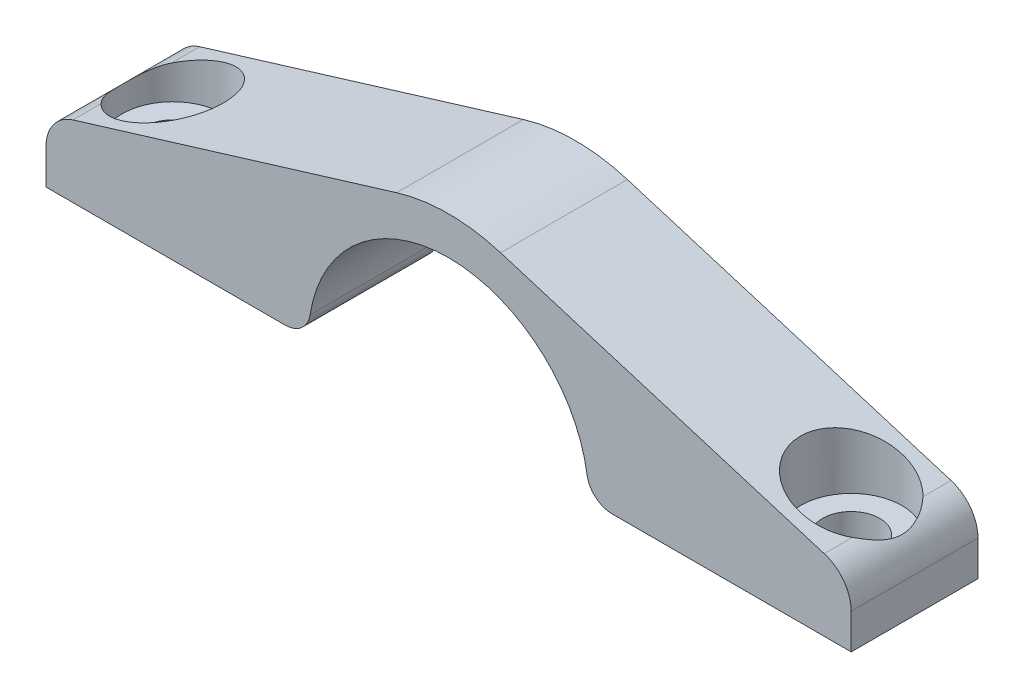
ISO-10303-21;
HEADER;
FILE_DESCRIPTION(('STEP AP214'),'2;1');
FILE_NAME('part.step','',(''),(''),'','','');
FILE_SCHEMA(('AUTOMOTIVE_DESIGN { 1 0 10303 214 1 1 1 1 }'));
ENDSEC;
DATA;
#1=APPLICATION_CONTEXT('core data for automotive mechanical design processes');
#2=APPLICATION_PROTOCOL_DEFINITION('international standard','automotive_design',2000,#1);
#3=PRODUCT_CONTEXT('',#1,'mechanical');
#4=PRODUCT('Part','Part','',(#3));
#5=PRODUCT_RELATED_PRODUCT_CATEGORY('part','',(#4));
#6=PRODUCT_DEFINITION_FORMATION('','',#4);
#7=PRODUCT_DEFINITION_CONTEXT('part definition',#1,'design');
#8=PRODUCT_DEFINITION('design','',#6,#7);
#9=PRODUCT_DEFINITION_SHAPE('','',#8);
#10=(LENGTH_UNIT() NAMED_UNIT(*) SI_UNIT(.MILLI.,.METRE.));
#11=(NAMED_UNIT(*) PLANE_ANGLE_UNIT() SI_UNIT($,.RADIAN.));
#12=(NAMED_UNIT(*) SI_UNIT($,.STERADIAN.) SOLID_ANGLE_UNIT());
#13=UNCERTAINTY_MEASURE_WITH_UNIT(LENGTH_MEASURE(1.E-05),#10,'distance_accuracy_value','');
#14=(GEOMETRIC_REPRESENTATION_CONTEXT(3) GLOBAL_UNCERTAINTY_ASSIGNED_CONTEXT((#13)) GLOBAL_UNIT_ASSIGNED_CONTEXT((#10,
#11,#12)) REPRESENTATION_CONTEXT('',''));
#15=CARTESIAN_POINT('',(0.,0.,0.));
#16=DIRECTION('',(0.,0.,1.));
#17=DIRECTION('',(1.,0.,0.));
#18=AXIS2_PLACEMENT_3D('',#15,#16,#17);
#19=CARTESIAN_POINT('',(0.,0.,10.));
#20=DIRECTION('',(0.,0.,-1.));
#21=DIRECTION('',(-1.,0.,0.));
#22=AXIS2_PLACEMENT_3D('',#19,#20,#21);
#23=CYLINDRICAL_SURFACE('',#22,11.05);
#24=CARTESIAN_POINT('',(0.,0.,0.));
#25=DIRECTION('',(0.,0.,-1.));
#26=DIRECTION('',(-1.,0.,0.));
#27=AXIS2_PLACEMENT_3D('',#24,#25,#26);
#28=CIRCLE('',#27,11.05);
#29=CARTESIAN_POINT('',(-10.9194598387173,1.69348659003831,0.));
#30=VERTEX_POINT('',#29);
#31=CARTESIAN_POINT('',(10.9194598387173,1.69348659003831,0.));
#32=VERTEX_POINT('',#31);
#33=EDGE_CURVE('E181',#30,#32,#28,.T.);
#34=ORIENTED_EDGE('',*,*,#33,.T.);
#35=DIRECTION('',(0.,0.,-1.));
#36=VECTOR('',#35,1.);
#37=CARTESIAN_POINT('',(10.9194598387173,1.69348659003831,10.));
#38=LINE('',#37,#36);
#39=CARTESIAN_POINT('',(10.9194598387173,1.69348659003831,10.));
#40=VERTEX_POINT('',#39);
#41=EDGE_CURVE('E220',#32,#40,#38,.F.);
#42=ORIENTED_EDGE('',*,*,#41,.T.);
#43=CARTESIAN_POINT('',(0.,0.,10.));
#44=DIRECTION('',(0.,0.,-1.));
#45=DIRECTION('',(-1.,0.,0.));
#46=AXIS2_PLACEMENT_3D('',#43,#44,#45);
#47=CIRCLE('',#46,11.05);
#48=CARTESIAN_POINT('',(-10.9194598387173,1.69348659003831,10.));
#49=VERTEX_POINT('',#48);
#50=EDGE_CURVE('E151',#49,#40,#47,.T.);
#51=ORIENTED_EDGE('',*,*,#50,.F.);
#52=DIRECTION('',(0.,0.,-1.));
#53=VECTOR('',#52,1.);
#54=CARTESIAN_POINT('',(-10.9194598387173,1.69348659003831,10.));
#55=LINE('',#54,#53);
#56=EDGE_CURVE('E217',#49,#30,#55,.T.);
#57=ORIENTED_EDGE('',*,*,#56,.T.);
#58=EDGE_LOOP('',(#34,#42,#51,#57));
#59=FACE_BOUND('',#58,.T.);
#60=ADVANCED_FACE('F38',(#59),#23,.F.);
#61=CARTESIAN_POINT('',(31.75,0.,10.));
#62=DIRECTION('',(0.,1.,0.));
#63=DIRECTION('',(0.,0.,1.));
#64=AXIS2_PLACEMENT_3D('',#61,#62,#63);
#65=PLANE('',#64);
#66=CARTESIAN_POINT('',(26.75,0.,5.));
#67=DIRECTION('',(0.,1.,0.));
#68=DIRECTION('',(0.,0.,1.));
#69=AXIS2_PLACEMENT_3D('',#66,#67,#68);
#70=CIRCLE('',#69,2.25);
#71=CARTESIAN_POINT('',(26.75,0.,7.25));
#72=VERTEX_POINT('',#71);
#73=EDGE_CURVE('E318',#72,#72,#70,.T.);
#74=ORIENTED_EDGE('',*,*,#73,.T.);
#75=EDGE_LOOP('',(#74));
#76=FACE_BOUND('',#75,.T.);
#77=DIRECTION('',(1.,0.,0.));
#78=VECTOR('',#77,1.);
#79=CARTESIAN_POINT('',(31.75,0.,10.));
#80=LINE('',#79,#78);
#81=CARTESIAN_POINT('',(12.8958326602046,0.,10.));
#82=VERTEX_POINT('',#81);
#83=CARTESIAN_POINT('',(31.75,0.,10.));
#84=VERTEX_POINT('',#83);
#85=EDGE_CURVE('E138',#82,#84,#80,.T.);
#86=ORIENTED_EDGE('',*,*,#85,.F.);
#87=DIRECTION('',(0.,0.,-1.));
#88=VECTOR('',#87,1.);
#89=CARTESIAN_POINT('',(12.8958326602046,0.,10.));
#90=LINE('',#89,#88);
#91=CARTESIAN_POINT('',(12.8958326602046,0.,0.));
#92=VERTEX_POINT('',#91);
#93=EDGE_CURVE('E211',#82,#92,#90,.T.);
#94=ORIENTED_EDGE('',*,*,#93,.T.);
#95=DIRECTION('',(1.,0.,0.));
#96=VECTOR('',#95,1.);
#97=CARTESIAN_POINT('',(31.75,0.,0.));
#98=LINE('',#97,#96);
#99=CARTESIAN_POINT('',(31.75,0.,0.));
#100=VERTEX_POINT('',#99);
#101=EDGE_CURVE('E157',#92,#100,#98,.T.);
#102=ORIENTED_EDGE('',*,*,#101,.T.);
#103=DIRECTION('',(0.,0.,-1.));
#104=VECTOR('',#103,1.);
#105=CARTESIAN_POINT('',(31.75,0.,10.));
#106=LINE('',#105,#104);
#107=EDGE_CURVE('E154',#84,#100,#106,.T.);
#108=ORIENTED_EDGE('',*,*,#107,.F.);
#109=EDGE_LOOP('',(#86,#94,#102,#108));
#110=FACE_BOUND('',#109,.T.);
#111=ADVANCED_FACE('F155',(#76,#110),#65,.F.);
#112=CARTESIAN_POINT('',(31.75,5.,10.));
#113=DIRECTION('',(-1.,0.,0.));
#114=DIRECTION('',(0.,0.,1.));
#115=AXIS2_PLACEMENT_3D('',#112,#113,#114);
#116=PLANE('',#115);
#117=DIRECTION('',(0.,1.,0.));
#118=VECTOR('',#117,1.);
#119=CARTESIAN_POINT('',(31.75,5.,0.));
#120=LINE('',#119,#118);
#121=CARTESIAN_POINT('',(31.75,2.77896608610913,0.));
#122=VERTEX_POINT('',#121);
#123=EDGE_CURVE('E186',#100,#122,#120,.T.);
#124=ORIENTED_EDGE('',*,*,#123,.T.);
#125=DIRECTION('',(0.,0.,-1.));
#126=VECTOR('',#125,1.);
#127=CARTESIAN_POINT('',(31.75,2.77896608610913,10.));
#128=LINE('',#127,#126);
#129=CARTESIAN_POINT('',(31.75,2.77896608610913,10.));
#130=VERTEX_POINT('',#129);
#131=EDGE_CURVE('E11',#122,#130,#128,.F.);
#132=ORIENTED_EDGE('',*,*,#131,.T.);
#133=DIRECTION('',(0.,1.,0.));
#134=VECTOR('',#133,1.);
#135=CARTESIAN_POINT('',(31.75,5.,10.));
#136=LINE('',#135,#134);
#137=EDGE_CURVE('E143',#84,#130,#136,.T.);
#138=ORIENTED_EDGE('',*,*,#137,.F.);
#139=ORIENTED_EDGE('',*,*,#107,.T.);
#140=EDGE_LOOP('',(#124,#132,#138,#139));
#141=FACE_BOUND('',#140,.T.);
#142=ADVANCED_FACE('F164',(#141),#116,.F.);
#143=CARTESIAN_POINT('',(31.75,5.,10.));
#144=DIRECTION('',(-0.291897709873633,-0.95644954230243,0.));
#145=DIRECTION('',(0.95644954230243,-0.291897709873633,0.));
#146=AXIS2_PLACEMENT_3D('',#143,#144,#145);
#147=PLANE('',#146);
#148=DIRECTION('',(-0.95644954230243,0.291897709873633,0.));
#149=VECTOR('',#148,1.);
#150=CARTESIAN_POINT('',(31.75,5.,10.));
#151=LINE('',#150,#149);
#152=CARTESIAN_POINT('',(29.6256931296209,5.64831471301642,10.));
#153=VERTEX_POINT('',#152);
#154=CARTESIAN_POINT('',(4.10116282372454,13.4381160693491,10.));
#155=VERTEX_POINT('',#154);
#156=EDGE_CURVE('E166',#153,#155,#151,.T.);
#157=ORIENTED_EDGE('',*,*,#156,.F.);
#158=DIRECTION('',(0.,0.,-1.));
#159=VECTOR('',#158,1.);
#160=CARTESIAN_POINT('',(29.6256931296209,5.64831471301642,10.));
#161=LINE('',#160,#159);
#162=CARTESIAN_POINT('',(29.6256931296209,5.64831471301642,7.78035771516025));
#163=VERTEX_POINT('',#162);
#164=EDGE_CURVE('E337',#153,#163,#161,.T.);
#165=ORIENTED_EDGE('',*,*,#164,.T.);
#166=CARTESIAN_POINT('',(26.75,6.52594411395167,5.));
#167=DIRECTION('',(-0.291897709873633,-0.95644954230243,0.));
#168=DIRECTION('',(-0.95644954230243,0.291897709873633,0.));
#169=AXIS2_PLACEMENT_3D('',#166,#167,#168);
#170=ELLIPSE('',#169,4.18213384301583,3.99999999999999);
#171=CARTESIAN_POINT('',(29.6256931296209,5.64831471301642,2.21964228483975));
#172=VERTEX_POINT('',#171);
#173=EDGE_CURVE('E209',#163,#172,#170,.T.);
#174=ORIENTED_EDGE('',*,*,#173,.T.);
#175=DIRECTION('',(0.,0.,-1.));
#176=VECTOR('',#175,1.);
#177=CARTESIAN_POINT('',(29.6256931296209,5.64831471301642,10.));
#178=LINE('',#177,#176);
#179=CARTESIAN_POINT('',(29.6256931296209,5.64831471301642,0.));
#180=VERTEX_POINT('',#179);
#181=EDGE_CURVE('E335',#172,#180,#178,.T.);
#182=ORIENTED_EDGE('',*,*,#181,.T.);
#183=DIRECTION('',(-0.95644954230243,0.291897709873633,0.));
#184=VECTOR('',#183,1.);
#185=CARTESIAN_POINT('',(31.75,5.,0.));
#186=LINE('',#185,#184);
#187=CARTESIAN_POINT('',(4.10116282372454,13.4381160693491,0.));
#188=VERTEX_POINT('',#187);
#189=EDGE_CURVE('E188',#180,#188,#186,.T.);
#190=ORIENTED_EDGE('',*,*,#189,.T.);
#191=DIRECTION('',(0.,0.,-1.));
#192=VECTOR('',#191,1.);
#193=CARTESIAN_POINT('',(4.10116282372454,13.4381160693491,10.));
#194=LINE('',#193,#192);
#195=EDGE_CURVE('E162',#155,#188,#194,.T.);
#196=ORIENTED_EDGE('',*,*,#195,.F.);
#197=EDGE_LOOP('',(#157,#165,#174,#182,#190,#196));
#198=FACE_BOUND('',#197,.T.);
#199=ADVANCED_FACE('F278',(#198),#147,.F.);
#200=CARTESIAN_POINT('',(0.,0.,10.));
#201=DIRECTION('',(0.,0.,-1.));
#202=DIRECTION('',(-1.,0.,0.));
#203=AXIS2_PLACEMENT_3D('',#200,#201,#202);
#204=CYLINDRICAL_SURFACE('',#203,14.05);
#205=CARTESIAN_POINT('',(0.,0.,0.));
#206=DIRECTION('',(0.,0.,1.));
#207=DIRECTION('',(-1.,0.,0.));
#208=AXIS2_PLACEMENT_3D('',#205,#206,#207);
#209=CIRCLE('',#208,14.05);
#210=CARTESIAN_POINT('',(-4.10116282372454,13.4381160693491,0.));
#211=VERTEX_POINT('',#210);
#212=EDGE_CURVE('E190',#188,#211,#209,.T.);
#213=ORIENTED_EDGE('',*,*,#212,.T.);
#214=DIRECTION('',(0.,0.,-1.));
#215=VECTOR('',#214,1.);
#216=CARTESIAN_POINT('',(-4.10116282372454,13.4381160693491,10.));
#217=LINE('',#216,#215);
#218=CARTESIAN_POINT('',(-4.10116282372454,13.4381160693491,10.));
#219=VERTEX_POINT('',#218);
#220=EDGE_CURVE('E202',#219,#211,#217,.T.);
#221=ORIENTED_EDGE('',*,*,#220,.F.);
#222=CARTESIAN_POINT('',(0.,0.,10.));
#223=DIRECTION('',(0.,0.,1.));
#224=DIRECTION('',(-1.,0.,0.));
#225=AXIS2_PLACEMENT_3D('',#222,#223,#224);
#226=CIRCLE('',#225,14.05);
#227=EDGE_CURVE('E168',#155,#219,#226,.T.);
#228=ORIENTED_EDGE('',*,*,#227,.F.);
#229=ORIENTED_EDGE('',*,*,#195,.T.);
#230=EDGE_LOOP('',(#213,#221,#228,#229));
#231=FACE_BOUND('',#230,.T.);
#232=ADVANCED_FACE('F274',(#231),#204,.T.);
#233=CARTESIAN_POINT('',(-31.75,5.,10.));
#234=DIRECTION('',(0.291897709873633,-0.95644954230243,0.));
#235=DIRECTION('',(0.95644954230243,0.291897709873633,0.));
#236=AXIS2_PLACEMENT_3D('',#233,#234,#235);
#237=PLANE('',#236);
#238=DIRECTION('',(-0.95644954230243,-0.291897709873633,0.));
#239=VECTOR('',#238,1.);
#240=CARTESIAN_POINT('',(-31.75,5.,0.));
#241=LINE('',#240,#239);
#242=CARTESIAN_POINT('',(-29.6256931296209,5.64831471301642,0.));
#243=VERTEX_POINT('',#242);
#244=EDGE_CURVE('E192',#211,#243,#241,.T.);
#245=ORIENTED_EDGE('',*,*,#244,.T.);
#246=DIRECTION('',(0.,0.,-1.));
#247=VECTOR('',#246,1.);
#248=CARTESIAN_POINT('',(-29.6256931296209,5.64831471301642,10.));
#249=LINE('',#248,#247);
#250=CARTESIAN_POINT('',(-29.6256931296209,5.64831471301642,2.21964228483975));
#251=VERTEX_POINT('',#250);
#252=EDGE_CURVE('E236',#243,#251,#249,.F.);
#253=ORIENTED_EDGE('',*,*,#252,.T.);
#254=CARTESIAN_POINT('',(-26.75,6.52594411395167,5.));
#255=DIRECTION('',(0.291897709873633,-0.95644954230243,0.));
#256=DIRECTION('',(-0.95644954230243,-0.291897709873633,0.));
#257=AXIS2_PLACEMENT_3D('',#254,#255,#256);
#258=ELLIPSE('',#257,4.18213384301583,4.);
#259=CARTESIAN_POINT('',(-29.6256931296209,5.64831471301642,7.78035771516025));
#260=VERTEX_POINT('',#259);
#261=EDGE_CURVE('E161',#251,#260,#258,.T.);
#262=ORIENTED_EDGE('',*,*,#261,.T.);
#263=DIRECTION('',(0.,0.,-1.));
#264=VECTOR('',#263,1.);
#265=CARTESIAN_POINT('',(-29.6256931296209,5.64831471301642,10.));
#266=LINE('',#265,#264);
#267=CARTESIAN_POINT('',(-29.6256931296209,5.64831471301642,10.));
#268=VERTEX_POINT('',#267);
#269=EDGE_CURVE('E234',#260,#268,#266,.F.);
#270=ORIENTED_EDGE('',*,*,#269,.T.);
#271=DIRECTION('',(-0.95644954230243,-0.291897709873633,0.));
#272=VECTOR('',#271,1.);
#273=CARTESIAN_POINT('',(-31.75,5.,10.));
#274=LINE('',#273,#272);
#275=EDGE_CURVE('E173',#219,#268,#274,.T.);
#276=ORIENTED_EDGE('',*,*,#275,.F.);
#277=ORIENTED_EDGE('',*,*,#220,.T.);
#278=EDGE_LOOP('',(#245,#253,#262,#270,#276,#277));
#279=FACE_BOUND('',#278,.T.);
#280=ADVANCED_FACE('F270',(#279),#237,.F.);
#281=CARTESIAN_POINT('',(-31.75,5.,10.));
#282=DIRECTION('',(1.,0.,0.));
#283=DIRECTION('',(0.,0.,-1.));
#284=AXIS2_PLACEMENT_3D('',#281,#282,#283);
#285=PLANE('',#284);
#286=DIRECTION('',(0.,-1.,0.));
#287=VECTOR('',#286,1.);
#288=CARTESIAN_POINT('',(-31.75,5.,10.));
#289=LINE('',#288,#287);
#290=CARTESIAN_POINT('',(-31.75,2.77896608610913,10.));
#291=VERTEX_POINT('',#290);
#292=CARTESIAN_POINT('',(-31.75,0.,10.));
#293=VERTEX_POINT('',#292);
#294=EDGE_CURVE('E175',#291,#293,#289,.T.);
#295=ORIENTED_EDGE('',*,*,#294,.F.);
#296=DIRECTION('',(0.,0.,-1.));
#297=VECTOR('',#296,1.);
#298=CARTESIAN_POINT('',(-31.75,2.77896608610913,10.));
#299=LINE('',#298,#297);
#300=CARTESIAN_POINT('',(-31.75,2.77896608610913,0.));
#301=VERTEX_POINT('',#300);
#302=EDGE_CURVE('E227',#291,#301,#299,.T.);
#303=ORIENTED_EDGE('',*,*,#302,.T.);
#304=DIRECTION('',(0.,-1.,0.));
#305=VECTOR('',#304,1.);
#306=CARTESIAN_POINT('',(-31.75,5.,0.));
#307=LINE('',#306,#305);
#308=CARTESIAN_POINT('',(-31.75,0.,0.));
#309=VERTEX_POINT('',#308);
#310=EDGE_CURVE('E195',#301,#309,#307,.T.);
#311=ORIENTED_EDGE('',*,*,#310,.T.);
#312=DIRECTION('',(0.,0.,-1.));
#313=VECTOR('',#312,1.);
#314=CARTESIAN_POINT('',(-31.75,0.,10.));
#315=LINE('',#314,#313);
#316=EDGE_CURVE('E180',#293,#309,#315,.T.);
#317=ORIENTED_EDGE('',*,*,#316,.F.);
#318=EDGE_LOOP('',(#295,#303,#311,#317));
#319=FACE_BOUND('',#318,.T.);
#320=ADVANCED_FACE('F266',(#319),#285,.F.);
#321=CARTESIAN_POINT('',(-31.75,0.,10.));
#322=DIRECTION('',(0.,1.,0.));
#323=DIRECTION('',(0.,0.,1.));
#324=AXIS2_PLACEMENT_3D('',#321,#322,#323);
#325=PLANE('',#324);
#326=CARTESIAN_POINT('',(-26.75,0.,5.));
#327=DIRECTION('',(0.,1.,0.));
#328=DIRECTION('',(0.,0.,1.));
#329=AXIS2_PLACEMENT_3D('',#326,#327,#328);
#330=CIRCLE('',#329,2.25);
#331=CARTESIAN_POINT('',(-26.75,0.,7.25));
#332=VERTEX_POINT('',#331);
#333=EDGE_CURVE('E184',#332,#332,#330,.T.);
#334=ORIENTED_EDGE('',*,*,#333,.T.);
#335=EDGE_LOOP('',(#334));
#336=FACE_BOUND('',#335,.T.);
#337=DIRECTION('',(1.,0.,0.));
#338=VECTOR('',#337,1.);
#339=CARTESIAN_POINT('',(-31.75,0.,0.));
#340=LINE('',#339,#338);
#341=CARTESIAN_POINT('',(-12.8958326602046,0.,0.));
#342=VERTEX_POINT('',#341);
#343=EDGE_CURVE('E197',#309,#342,#340,.T.);
#344=ORIENTED_EDGE('',*,*,#343,.T.);
#345=DIRECTION('',(0.,0.,-1.));
#346=VECTOR('',#345,1.);
#347=CARTESIAN_POINT('',(-12.8958326602046,0.,10.));
#348=LINE('',#347,#346);
#349=CARTESIAN_POINT('',(-12.8958326602046,0.,10.));
#350=VERTEX_POINT('',#349);
#351=EDGE_CURVE('E225',#342,#350,#348,.F.);
#352=ORIENTED_EDGE('',*,*,#351,.T.);
#353=DIRECTION('',(1.,0.,0.));
#354=VECTOR('',#353,1.);
#355=CARTESIAN_POINT('',(-31.75,0.,10.));
#356=LINE('',#355,#354);
#357=EDGE_CURVE('E177',#293,#350,#356,.T.);
#358=ORIENTED_EDGE('',*,*,#357,.F.);
#359=ORIENTED_EDGE('',*,*,#316,.T.);
#360=EDGE_LOOP('',(#344,#352,#358,#359));
#361=FACE_BOUND('',#360,.T.);
#362=ADVANCED_FACE('F260',(#336,#361),#325,.F.);
#363=CARTESIAN_POINT('',(0.,0.,10.));
#364=DIRECTION('',(0.,0.,-1.));
#365=DIRECTION('',(-1.,0.,0.));
#366=AXIS2_PLACEMENT_3D('',#363,#364,#365);
#367=PLANE('',#366);
#368=ORIENTED_EDGE('',*,*,#275,.T.);
#369=CARTESIAN_POINT('',(-28.75,2.77896608610913,10.));
#370=DIRECTION('',(0.,0.,-1.));
#371=DIRECTION('',(-1.,0.,0.));
#372=AXIS2_PLACEMENT_3D('',#369,#370,#371);
#373=CIRCLE('',#372,3.);
#374=EDGE_CURVE('E339',#268,#291,#373,.F.);
#375=ORIENTED_EDGE('',*,*,#374,.T.);
#376=ORIENTED_EDGE('',*,*,#294,.T.);
#377=ORIENTED_EDGE('',*,*,#357,.T.);
#378=CARTESIAN_POINT('',(-12.8958326602046,2.,10.));
#379=DIRECTION('',(0.,0.,-1.));
#380=DIRECTION('',(-1.,0.,0.));
#381=AXIS2_PLACEMENT_3D('',#378,#379,#380);
#382=CIRCLE('',#381,2.);
#383=EDGE_CURVE('E222',#350,#49,#382,.F.);
#384=ORIENTED_EDGE('',*,*,#383,.T.);
#385=ORIENTED_EDGE('',*,*,#50,.T.);
#386=CARTESIAN_POINT('',(12.8958326602046,2.,10.));
#387=DIRECTION('',(0.,0.,-1.));
#388=DIRECTION('',(-1.,0.,0.));
#389=AXIS2_PLACEMENT_3D('',#386,#387,#388);
#390=CIRCLE('',#389,2.);
#391=EDGE_CURVE('E147',#40,#82,#390,.F.);
#392=ORIENTED_EDGE('',*,*,#391,.T.);
#393=ORIENTED_EDGE('',*,*,#85,.T.);
#394=ORIENTED_EDGE('',*,*,#137,.T.);
#395=CARTESIAN_POINT('',(28.75,2.77896608610913,10.));
#396=DIRECTION('',(0.,0.,-1.));
#397=DIRECTION('',(-1.,0.,0.));
#398=AXIS2_PLACEMENT_3D('',#395,#396,#397);
#399=CIRCLE('',#398,3.);
#400=EDGE_CURVE('E244',#130,#153,#399,.F.);
#401=ORIENTED_EDGE('',*,*,#400,.T.);
#402=ORIENTED_EDGE('',*,*,#156,.T.);
#403=ORIENTED_EDGE('',*,*,#227,.T.);
#404=EDGE_LOOP('',(#368,#375,#376,#377,#384,#385,#392,#393,#394,#401,#402,#403));
#405=FACE_BOUND('',#404,.T.);
#406=ADVANCED_FACE('F141',(#405),#367,.F.);
#407=CARTESIAN_POINT('',(0.,0.,0.));
#408=DIRECTION('',(0.,0.,-1.));
#409=DIRECTION('',(-1.,0.,0.));
#410=AXIS2_PLACEMENT_3D('',#407,#408,#409);
#411=PLANE('',#410);
#412=ORIENTED_EDGE('',*,*,#310,.F.);
#413=CARTESIAN_POINT('',(-28.75,2.77896608610913,0.));
#414=DIRECTION('',(0.,0.,-1.));
#415=DIRECTION('',(-1.,0.,0.));
#416=AXIS2_PLACEMENT_3D('',#413,#414,#415);
#417=CIRCLE('',#416,3.);
#418=EDGE_CURVE('E232',#301,#243,#417,.T.);
#419=ORIENTED_EDGE('',*,*,#418,.T.);
#420=ORIENTED_EDGE('',*,*,#244,.F.);
#421=ORIENTED_EDGE('',*,*,#212,.F.);
#422=ORIENTED_EDGE('',*,*,#189,.F.);
#423=CARTESIAN_POINT('',(28.75,2.77896608610913,0.));
#424=DIRECTION('',(0.,0.,-1.));
#425=DIRECTION('',(-1.,0.,0.));
#426=AXIS2_PLACEMENT_3D('',#423,#424,#425);
#427=CIRCLE('',#426,3.);
#428=EDGE_CURVE('E230',#180,#122,#427,.T.);
#429=ORIENTED_EDGE('',*,*,#428,.T.);
#430=ORIENTED_EDGE('',*,*,#123,.F.);
#431=ORIENTED_EDGE('',*,*,#101,.F.);
#432=CARTESIAN_POINT('',(12.8958326602046,2.,0.));
#433=DIRECTION('',(0.,0.,-1.));
#434=DIRECTION('',(-1.,0.,0.));
#435=AXIS2_PLACEMENT_3D('',#432,#433,#434);
#436=CIRCLE('',#435,2.);
#437=EDGE_CURVE('E215',#92,#32,#436,.T.);
#438=ORIENTED_EDGE('',*,*,#437,.T.);
#439=ORIENTED_EDGE('',*,*,#33,.F.);
#440=CARTESIAN_POINT('',(-12.8958326602046,2.,0.));
#441=DIRECTION('',(0.,0.,-1.));
#442=DIRECTION('',(-1.,0.,0.));
#443=AXIS2_PLACEMENT_3D('',#440,#441,#442);
#444=CIRCLE('',#443,2.);
#445=EDGE_CURVE('E213',#30,#342,#444,.T.);
#446=ORIENTED_EDGE('',*,*,#445,.T.);
#447=ORIENTED_EDGE('',*,*,#343,.F.);
#448=EDGE_LOOP('',(#412,#419,#420,#421,#422,#429,#430,#431,#438,#439,#446,#447));
#449=FACE_BOUND('',#448,.T.);
#450=ADVANCED_FACE('F255',(#449),#411,.T.);
#451=CARTESIAN_POINT('',(-26.75,7.,5.));
#452=DIRECTION('',(0.,-1.,0.));
#453=DIRECTION('',(0.,0.,-1.));
#454=AXIS2_PLACEMENT_3D('',#451,#452,#453);
#455=CYLINDRICAL_SURFACE('',#454,4.);
#456=ORIENTED_EDGE('',*,*,#261,.F.);
#457=CARTESIAN_POINT('',(-29.6256931296209,5.64831471301642,2.21964228483975));
#458=CARTESIAN_POINT('',(-29.7123088577774,5.62188068460178,2.30924989376314));
#459=CARTESIAN_POINT('',(-29.7942676823549,5.59258261836363,2.40237657012953));
#460=CARTESIAN_POINT('',(-29.9486676753114,5.53035098994619,2.59504828280792));
#461=CARTESIAN_POINT('',(-30.0211117332531,5.49741853711981,2.69459135675412));
#462=CARTESIAN_POINT('',(-30.1569829481515,5.42966714253461,2.90051901495854));
#463=CARTESIAN_POINT('',(-30.2203164660069,5.39483307734777,3.00696029330476));
#464=CARTESIAN_POINT('',(-30.3369144333084,5.32578630658522,3.22534916340262));
#465=CARTESIAN_POINT('',(-30.3901801287414,5.29157352459427,3.33729607161743));
#466=CARTESIAN_POINT('',(-30.5118772029086,5.20872207157995,3.62727325382415));
#467=CARTESIAN_POINT('',(-30.5734067004213,5.16203607807235,3.80891063901975));
#468=CARTESIAN_POINT('',(-30.6459229315352,5.10413902079427,4.08840266473516));
#469=CARTESIAN_POINT('',(-30.6667765835465,5.08688446706856,4.18254404007751));
#470=CARTESIAN_POINT('',(-30.7017089786908,5.05742094161233,4.37283318135702));
#471=CARTESIAN_POINT('',(-30.7157917585726,5.04520896414608,4.46897971606404));
#472=CARTESIAN_POINT('',(-30.7370520922472,5.02659356404207,4.66368193833046));
#473=CARTESIAN_POINT('',(-30.7441519909324,5.0202555077696,4.76225249257991));
#474=CARTESIAN_POINT('',(-30.7510198914604,5.01412633243836,4.95985081605335));
#475=CARTESIAN_POINT('',(-30.7507883441801,5.014334810774,5.0588785567863));
#476=CARTESIAN_POINT('',(-30.7429899076511,5.02129043656964,5.25657234831845));
#477=CARTESIAN_POINT('',(-30.7354113628385,5.02804797370719,5.35523757432836));
#478=CARTESIAN_POINT('',(-30.7130799681644,5.04756238728618,5.55112083530859));
#479=CARTESIAN_POINT('',(-30.6983260601139,5.06032014860342,5.64833865464205));
#480=CARTESIAN_POINT('',(-30.6407108051431,5.10875046092686,5.95239044108339));
#481=CARTESIAN_POINT('',(-30.5851020948398,5.15383251474597,6.15547947719238));
#482=CARTESIAN_POINT('',(-30.4796237132595,5.23055275400057,6.44943010883753));
#483=CARTESIAN_POINT('',(-30.440712076559,5.25768968058505,6.54576889956834));
#484=CARTESIAN_POINT('',(-30.3557350512444,5.31356836717176,6.73475839326742));
#485=CARTESIAN_POINT('',(-30.3096709334774,5.34230984149933,6.82740974774944));
#486=CARTESIAN_POINT('',(-30.1745294949134,5.42102949837721,7.07471586318187));
#487=CARTESIAN_POINT('',(-30.0784951908023,5.47128405127432,7.22557719620428));
#488=CARTESIAN_POINT('',(-29.9195867794605,5.54219288202463,7.44165164114943));
#489=CARTESIAN_POINT('',(-29.8642844053494,5.56503650298415,7.51182468128541));
#490=CARTESIAN_POINT('',(-29.7487048403234,5.60852354539333,7.64873366780542));
#491=CARTESIAN_POINT('',(-29.6884248928639,5.62916573300832,7.71546767600438));
#492=CARTESIAN_POINT('',(-29.6256931296209,5.64831471301642,7.78035771516025));
#493=B_SPLINE_CURVE_WITH_KNOTS('',3,(#457,#458,#459,#460,#461,#462,#463,#464,#465,#466,#467,
#468,#469,#470,#471,#472,#473,#474,#475,#476,#477,#478,#479,#480,#481,#482,#483,#484,#485,#486,
#487,#488,#489,#490,#491,#492),.UNSPECIFIED.,.F.,.F.,(4,2,2,2,2,2,2,2,2,2,2,2,2,2,2,2,2,4),(0.,
0.381893462427263,0.763670677194117,1.14912763693706,1.53453686151102,2.12400152515476,
2.41756177199783,2.71094678247852,3.0075587680046,3.30415251221351,3.60121755561794,
3.89832642207372,4.54029509602105,4.86224166398023,5.18413109405119,5.73959500720649,
6.01606574086998,6.29269062231022),.UNSPECIFIED.);
#494=EDGE_CURVE('E238',#251,#260,#493,.T.);
#495=ORIENTED_EDGE('',*,*,#494,.T.);
#496=EDGE_LOOP('',(#456,#495));
#497=FACE_BOUND('',#496,.T.);
#498=CARTESIAN_POINT('',(-26.75,3.,5.));
#499=DIRECTION('',(0.,1.,0.));
#500=DIRECTION('',(0.,0.,1.));
#501=AXIS2_PLACEMENT_3D('',#498,#499,#500);
#502=CIRCLE('',#501,3.99999999999999);
#503=CARTESIAN_POINT('',(-26.75,3.,8.99999999999999));
#504=VERTEX_POINT('',#503);
#505=EDGE_CURVE('E315',#504,#504,#502,.T.);
#506=ORIENTED_EDGE('',*,*,#505,.F.);
#507=EDGE_LOOP('',(#506));
#508=FACE_BOUND('',#507,.T.);
#509=ADVANCED_FACE('F249',(#497,#508),#455,.F.);
#510=CARTESIAN_POINT('',(-26.75,7.,5.));
#511=DIRECTION('',(0.,1.,0.));
#512=DIRECTION('',(0.,0.,1.));
#513=AXIS2_PLACEMENT_3D('',#510,#511,#512);
#514=CYLINDRICAL_SURFACE('',#513,2.25000000000001);
#515=ORIENTED_EDGE('',*,*,#333,.F.);
#516=EDGE_LOOP('',(#515));
#517=FACE_BOUND('',#516,.T.);
#518=CARTESIAN_POINT('',(-26.75,3.,5.));
#519=DIRECTION('',(0.,1.,0.));
#520=DIRECTION('',(0.,0.,1.));
#521=AXIS2_PLACEMENT_3D('',#518,#519,#520);
#522=CIRCLE('',#521,2.25000000000001);
#523=CARTESIAN_POINT('',(-26.75,3.,7.25000000000001));
#524=VERTEX_POINT('',#523);
#525=EDGE_CURVE('E312',#524,#524,#522,.T.);
#526=ORIENTED_EDGE('',*,*,#525,.T.);
#527=EDGE_LOOP('',(#526));
#528=FACE_BOUND('',#527,.T.);
#529=ADVANCED_FACE('F254',(#517,#528),#514,.F.);
#530=CARTESIAN_POINT('',(-24.5,3.,5.));
#531=DIRECTION('',(0.,-1.,0.));
#532=DIRECTION('',(0.,0.,-1.));
#533=AXIS2_PLACEMENT_3D('',#530,#531,#532);
#534=PLANE('',#533);
#535=ORIENTED_EDGE('',*,*,#525,.F.);
#536=EDGE_LOOP('',(#535));
#537=FACE_BOUND('',#536,.T.);
#538=ORIENTED_EDGE('',*,*,#505,.T.);
#539=EDGE_LOOP('',(#538));
#540=FACE_BOUND('',#539,.T.);
#541=ADVANCED_FACE('F332',(#537,#540),#534,.F.);
#542=CARTESIAN_POINT('',(26.75,7.00000000000001,5.));
#543=DIRECTION('',(0.,1.,0.));
#544=DIRECTION('',(0.,0.,1.));
#545=AXIS2_PLACEMENT_3D('',#542,#543,#544);
#546=CYLINDRICAL_SURFACE('',#545,3.99999999999999);
#547=CARTESIAN_POINT('',(26.75,3.00000000000001,5.));
#548=DIRECTION('',(0.,1.,0.));
#549=DIRECTION('',(0.,0.,1.));
#550=AXIS2_PLACEMENT_3D('',#547,#548,#549);
#551=CIRCLE('',#550,3.99999999999999);
#552=CARTESIAN_POINT('',(26.75,3.00000000000001,8.99999999999999));
#553=VERTEX_POINT('',#552);
#554=EDGE_CURVE('E324',#553,#553,#551,.T.);
#555=ORIENTED_EDGE('',*,*,#554,.F.);
#556=EDGE_LOOP('',(#555));
#557=FACE_BOUND('',#556,.T.);
#558=ORIENTED_EDGE('',*,*,#173,.F.);
#559=CARTESIAN_POINT('',(29.6256931296209,5.64831471301642,7.78035771516025));
#560=CARTESIAN_POINT('',(29.7123088577774,5.62188068460178,7.69075010623686));
#561=CARTESIAN_POINT('',(29.7942676823549,5.59258261836363,7.59762342987047));
#562=CARTESIAN_POINT('',(29.9486676753115,5.53035098994619,7.40495171719208));
#563=CARTESIAN_POINT('',(30.0211117332531,5.49741853711981,7.30540864324588));
#564=CARTESIAN_POINT('',(30.1569829481515,5.42966714253461,7.09948098504147));
#565=CARTESIAN_POINT('',(30.2203164660069,5.39483307734777,6.99303970669525));
#566=CARTESIAN_POINT('',(30.3369144333084,5.32578630658522,6.77465083659738));
#567=CARTESIAN_POINT('',(30.3901801287414,5.29157352459427,6.66270392838258));
#568=CARTESIAN_POINT('',(30.5118772029086,5.20872207157995,6.37272674617585));
#569=CARTESIAN_POINT('',(30.5734067004213,5.16203607807236,6.19108936098026));
#570=CARTESIAN_POINT('',(30.6459229315352,5.10413902079427,5.91159733526485));
#571=CARTESIAN_POINT('',(30.6667765835465,5.08688446706856,5.8174559599225));
#572=CARTESIAN_POINT('',(30.7017089786908,5.05742094161233,5.62716681864299));
#573=CARTESIAN_POINT('',(30.7157917585726,5.04520896414608,5.53102028393597));
#574=CARTESIAN_POINT('',(30.7370520922472,5.02659356404208,5.33631806166954));
#575=CARTESIAN_POINT('',(30.7441519909325,5.0202555077696,5.2377475074201));
#576=CARTESIAN_POINT('',(30.7510198914604,5.01412633243836,5.04014918394666));
#577=CARTESIAN_POINT('',(30.7507883441801,5.014334810774,4.9411214432137));
#578=CARTESIAN_POINT('',(30.7429899076511,5.02129043656964,4.74342765168155));
#579=CARTESIAN_POINT('',(30.7354113628385,5.02804797370719,4.64476242567165));
#580=CARTESIAN_POINT('',(30.7130799681644,5.04756238728618,4.44887916469142));
#581=CARTESIAN_POINT('',(30.6983260601139,5.06032014860342,4.35166134535796));
#582=CARTESIAN_POINT('',(30.6407108051432,5.10875046092686,4.04760955891662));
#583=CARTESIAN_POINT('',(30.5851020948399,5.15383251474597,3.84452052280763));
#584=CARTESIAN_POINT('',(30.4796237132595,5.23055275400057,3.55056989116247));
#585=CARTESIAN_POINT('',(30.440712076559,5.25768968058504,3.45423110043167));
#586=CARTESIAN_POINT('',(30.3557350512444,5.31356836717176,3.26524160673259));
#587=CARTESIAN_POINT('',(30.3096709334774,5.34230984149933,3.17259025225057));
#588=CARTESIAN_POINT('',(30.1745294949134,5.42102949837721,2.92528413681813));
#589=CARTESIAN_POINT('',(30.0784951908024,5.47128405127432,2.77442280379573));
#590=CARTESIAN_POINT('',(29.9195867794605,5.54219288202463,2.55834835885058));
#591=CARTESIAN_POINT('',(29.8642844053494,5.56503650298415,2.48817531871459));
#592=CARTESIAN_POINT('',(29.7487048403234,5.60852354539334,2.35126633219458));
#593=CARTESIAN_POINT('',(29.6884248928639,5.62916573300832,2.28453232399562));
#594=CARTESIAN_POINT('',(29.6256931296209,5.64831471301642,2.21964228483975));
#595=B_SPLINE_CURVE_WITH_KNOTS('',3,(#559,#560,#561,#562,#563,#564,#565,#566,#567,#568,#569,
#570,#571,#572,#573,#574,#575,#576,#577,#578,#579,#580,#581,#582,#583,#584,#585,#586,#587,#588,
#589,#590,#591,#592,#593,#594),.UNSPECIFIED.,.F.,.F.,(4,2,2,2,2,2,2,2,2,2,2,2,2,2,2,2,2,4),(0.,
0.381893462427263,0.763670677194117,1.14912763693706,1.53453686151102,2.12400152515476,
2.41756177199782,2.71094678247851,3.0075587680046,3.30415251221351,3.60121755561793,
3.89832642207372,4.54029509602104,4.86224166398022,5.18413109405119,5.73959500720649,
6.01606574086999,6.29269062231023),.UNSPECIFIED.);
#596=EDGE_CURVE('E47',#163,#172,#595,.T.);
#597=ORIENTED_EDGE('',*,*,#596,.T.);
#598=EDGE_LOOP('',(#558,#597));
#599=FACE_BOUND('',#598,.T.);
#600=ADVANCED_FACE('F329',(#557,#599),#546,.F.);
#601=CARTESIAN_POINT('',(26.75,7.00000000000001,5.));
#602=DIRECTION('',(0.,1.,0.));
#603=DIRECTION('',(0.,0.,1.));
#604=AXIS2_PLACEMENT_3D('',#601,#602,#603);
#605=CYLINDRICAL_SURFACE('',#604,2.25000000000001);
#606=ORIENTED_EDGE('',*,*,#73,.F.);
#607=EDGE_LOOP('',(#606));
#608=FACE_BOUND('',#607,.T.);
#609=CARTESIAN_POINT('',(26.75,3.00000000000001,5.));
#610=DIRECTION('',(0.,1.,0.));
#611=DIRECTION('',(0.,0.,1.));
#612=AXIS2_PLACEMENT_3D('',#609,#610,#611);
#613=CIRCLE('',#612,2.25000000000001);
#614=CARTESIAN_POINT('',(26.75,3.00000000000001,7.25000000000001));
#615=VERTEX_POINT('',#614);
#616=EDGE_CURVE('E321',#615,#615,#613,.T.);
#617=ORIENTED_EDGE('',*,*,#616,.T.);
#618=EDGE_LOOP('',(#617));
#619=FACE_BOUND('',#618,.T.);
#620=ADVANCED_FACE('F331',(#608,#619),#605,.F.);
#621=CARTESIAN_POINT('',(29.,3.00000000000001,5.));
#622=DIRECTION('',(0.,-1.,0.));
#623=DIRECTION('',(0.,0.,-1.));
#624=AXIS2_PLACEMENT_3D('',#621,#622,#623);
#625=PLANE('',#624);
#626=ORIENTED_EDGE('',*,*,#616,.F.);
#627=EDGE_LOOP('',(#626));
#628=FACE_BOUND('',#627,.T.);
#629=ORIENTED_EDGE('',*,*,#554,.T.);
#630=EDGE_LOOP('',(#629));
#631=FACE_BOUND('',#630,.T.);
#632=ADVANCED_FACE('F294',(#628,#631),#625,.F.);
#633=CARTESIAN_POINT('',(12.8958326602046,2.,10.));
#634=DIRECTION('',(0.,0.,-1.));
#635=DIRECTION('',(-1.,0.,0.));
#636=AXIS2_PLACEMENT_3D('',#633,#634,#635);
#637=CYLINDRICAL_SURFACE('',#636,2.);
#638=ORIENTED_EDGE('',*,*,#391,.F.);
#639=ORIENTED_EDGE('',*,*,#41,.F.);
#640=ORIENTED_EDGE('',*,*,#437,.F.);
#641=ORIENTED_EDGE('',*,*,#93,.F.);
#642=EDGE_LOOP('',(#638,#639,#640,#641));
#643=FACE_BOUND('',#642,.T.);
#644=ADVANCED_FACE('F291',(#643),#637,.T.);
#645=CARTESIAN_POINT('',(-12.8958326602046,2.,10.));
#646=DIRECTION('',(0.,0.,-1.));
#647=DIRECTION('',(-1.,0.,0.));
#648=AXIS2_PLACEMENT_3D('',#645,#646,#647);
#649=CYLINDRICAL_SURFACE('',#648,2.);
#650=ORIENTED_EDGE('',*,*,#383,.F.);
#651=ORIENTED_EDGE('',*,*,#351,.F.);
#652=ORIENTED_EDGE('',*,*,#445,.F.);
#653=ORIENTED_EDGE('',*,*,#56,.F.);
#654=EDGE_LOOP('',(#650,#651,#652,#653));
#655=FACE_BOUND('',#654,.T.);
#656=ADVANCED_FACE('F293',(#655),#649,.T.);
#657=CARTESIAN_POINT('',(-28.75,2.77896608610913,10.));
#658=DIRECTION('',(0.,0.,-1.));
#659=DIRECTION('',(-1.,0.,0.));
#660=AXIS2_PLACEMENT_3D('',#657,#658,#659);
#661=CYLINDRICAL_SURFACE('',#660,3.);
#662=ORIENTED_EDGE('',*,*,#494,.F.);
#663=ORIENTED_EDGE('',*,*,#252,.F.);
#664=ORIENTED_EDGE('',*,*,#418,.F.);
#665=ORIENTED_EDGE('',*,*,#302,.F.);
#666=ORIENTED_EDGE('',*,*,#374,.F.);
#667=ORIENTED_EDGE('',*,*,#269,.F.);
#668=EDGE_LOOP('',(#662,#663,#664,#665,#666,#667));
#669=FACE_BOUND('',#668,.T.);
#670=ADVANCED_FACE('F246',(#669),#661,.T.);
#671=CARTESIAN_POINT('',(28.75,2.77896608610913,10.));
#672=DIRECTION('',(0.,0.,-1.));
#673=DIRECTION('',(-1.,0.,0.));
#674=AXIS2_PLACEMENT_3D('',#671,#672,#673);
#675=CYLINDRICAL_SURFACE('',#674,3.);
#676=ORIENTED_EDGE('',*,*,#400,.F.);
#677=ORIENTED_EDGE('',*,*,#131,.F.);
#678=ORIENTED_EDGE('',*,*,#428,.F.);
#679=ORIENTED_EDGE('',*,*,#181,.F.);
#680=ORIENTED_EDGE('',*,*,#596,.F.);
#681=ORIENTED_EDGE('',*,*,#164,.F.);
#682=EDGE_LOOP('',(#676,#677,#678,#679,#680,#681));
#683=FACE_BOUND('',#682,.T.);
#684=ADVANCED_FACE('F40',(#683),#675,.T.);
#685=CLOSED_SHELL('',(#60,#111,#142,#199,#232,#280,#320,#362,#406,#450,#509,#529,#541,#600,#620,
#632,#644,#656,#670,#684));
#686=MANIFOLD_SOLID_BREP('B2',#685);
#687=ADVANCED_BREP_SHAPE_REPRESENTATION('',(#18,#686),#14);
#688=SHAPE_DEFINITION_REPRESENTATION(#9,#687);
ENDSEC;
END-ISO-10303-21;
